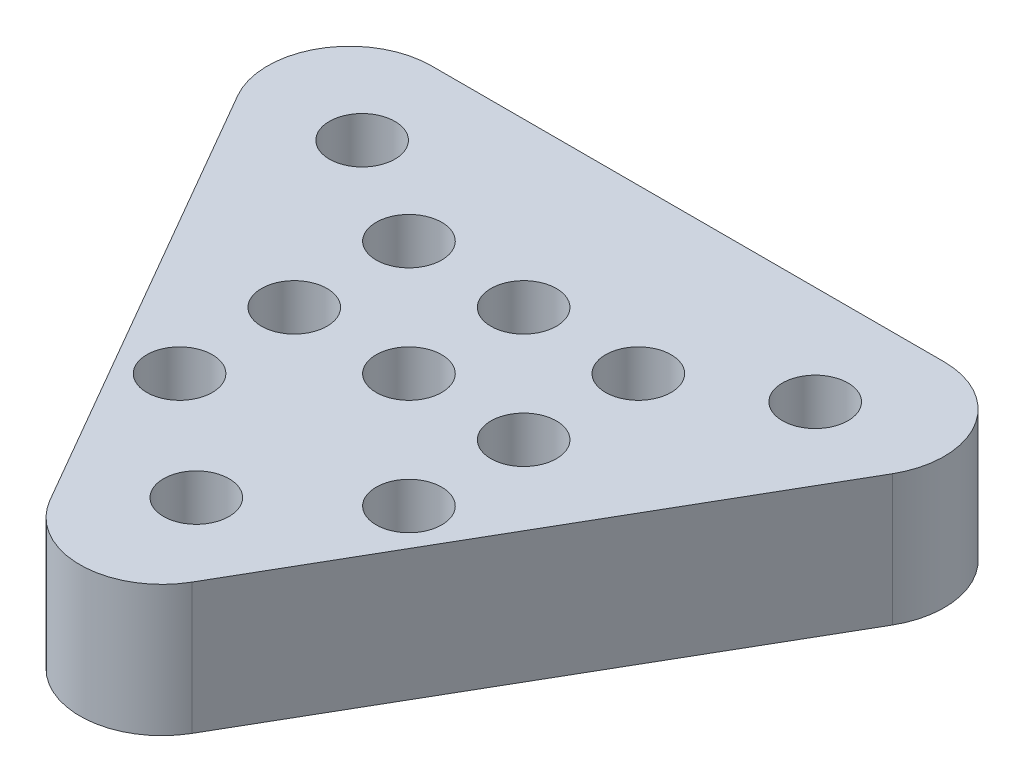
ISO-10303-21;
HEADER;
FILE_DESCRIPTION(('STEP AP214'),'2;1');
FILE_NAME('part.step','',(''),(''),'','','');
FILE_SCHEMA(('AUTOMOTIVE_DESIGN { 1 0 10303 214 1 1 1 1 }'));
ENDSEC;
DATA;
#1=APPLICATION_CONTEXT('core data for automotive mechanical design processes');
#2=APPLICATION_PROTOCOL_DEFINITION('international standard','automotive_design',2000,#1);
#3=PRODUCT_CONTEXT('',#1,'mechanical');
#4=PRODUCT('Part','Part','',(#3));
#5=PRODUCT_RELATED_PRODUCT_CATEGORY('part','',(#4));
#6=PRODUCT_DEFINITION_FORMATION('','',#4);
#7=PRODUCT_DEFINITION_CONTEXT('part definition',#1,'design');
#8=PRODUCT_DEFINITION('design','',#6,#7);
#9=PRODUCT_DEFINITION_SHAPE('','',#8);
#10=(LENGTH_UNIT() NAMED_UNIT(*) SI_UNIT(.MILLI.,.METRE.));
#11=(NAMED_UNIT(*) PLANE_ANGLE_UNIT() SI_UNIT($,.RADIAN.));
#12=(NAMED_UNIT(*) SI_UNIT($,.STERADIAN.) SOLID_ANGLE_UNIT());
#13=UNCERTAINTY_MEASURE_WITH_UNIT(LENGTH_MEASURE(1.E-05),#10,'distance_accuracy_value','');
#14=(GEOMETRIC_REPRESENTATION_CONTEXT(3) GLOBAL_UNCERTAINTY_ASSIGNED_CONTEXT((#13)) GLOBAL_UNIT_ASSIGNED_CONTEXT((#10,
#11,#12)) REPRESENTATION_CONTEXT('',''));
#15=CARTESIAN_POINT('',(0.,0.,0.));
#16=DIRECTION('',(0.,0.,1.));
#17=DIRECTION('',(1.,0.,0.));
#18=AXIS2_PLACEMENT_3D('',#15,#16,#17);
#19=CARTESIAN_POINT('',(-16.4111309816016,0.,1.40670066691417));
#20=DIRECTION('',(0.,1.,0.));
#21=DIRECTION('',(0.,0.,1.));
#22=AXIS2_PLACEMENT_3D('',#19,#20,#21);
#23=PLANE('',#22);
#24=CARTESIAN_POINT('',(11.7162263998497,0.,-4.04060624423478));
#25=DIRECTION('',(0.,1.,0.));
#26=DIRECTION('',(0.,0.,1.));
#27=AXIS2_PLACEMENT_3D('',#24,#25,#26);
#28=CIRCLE('',#27,2.38124999999978);
#29=CARTESIAN_POINT('',(11.7162263998497,0.,-1.659356244235));
#30=VERTEX_POINT('',#29);
#31=EDGE_CURVE('E297',#30,#30,#28,.T.);
#32=ORIENTED_EDGE('',*,*,#31,.T.);
#33=EDGE_LOOP('',(#32));
#34=FACE_BOUND('',#33,.T.);
#35=CARTESIAN_POINT('',(1.27033463203929,0.,-2.08860210500944));
#36=DIRECTION('',(0.,1.,0.));
#37=DIRECTION('',(0.,0.,1.));
#38=AXIS2_PLACEMENT_3D('',#35,#36,#37);
#39=CIRCLE('',#38,0.99999999999935);
#40=CARTESIAN_POINT('',(1.27033463203929,0.,-1.08860210501009));
#41=VERTEX_POINT('',#40);
#42=EDGE_CURVE('E181',#41,#41,#39,.T.);
#43=ORIENTED_EDGE('',*,*,#42,.T.);
#44=EDGE_LOOP('',(#43));
#45=FACE_BOUND('',#44,.T.);
#46=CARTESIAN_POINT('',(4.77033463203928,0.,-2.08860210500944));
#47=DIRECTION('',(0.,1.,0.));
#48=DIRECTION('',(0.,0.,1.));
#49=AXIS2_PLACEMENT_3D('',#46,#47,#48);
#50=CIRCLE('',#49,0.999999999999352);
#51=CARTESIAN_POINT('',(4.77033463203928,0.,-1.08860210501009));
#52=VERTEX_POINT('',#51);
#53=EDGE_CURVE('E178',#52,#52,#50,.T.);
#54=ORIENTED_EDGE('',*,*,#53,.T.);
#55=EDGE_LOOP('',(#54));
#56=FACE_BOUND('',#55,.T.);
#57=CARTESIAN_POINT('',(8.27033463203928,0.,-2.08860210500944));
#58=DIRECTION('',(0.,1.,0.));
#59=DIRECTION('',(0.,0.,1.));
#60=AXIS2_PLACEMENT_3D('',#57,#58,#59);
#61=CIRCLE('',#60,0.999999999999352);
#62=CARTESIAN_POINT('',(8.27033463203928,0.,-1.08860210501009));
#63=VERTEX_POINT('',#62);
#64=EDGE_CURVE('E175',#63,#63,#61,.T.);
#65=ORIENTED_EDGE('',*,*,#64,.T.);
#66=EDGE_LOOP('',(#65));
#67=FACE_BOUND('',#66,.T.);
#68=CARTESIAN_POINT('',(1.27033463203932,0.,1.41139789499056));
#69=DIRECTION('',(0.,1.,0.));
#70=DIRECTION('',(0.,0.,1.));
#71=AXIS2_PLACEMENT_3D('',#68,#69,#70);
#72=CIRCLE('',#71,0.99999999999935);
#73=CARTESIAN_POINT('',(1.27033463203932,0.,2.41139789498991));
#74=VERTEX_POINT('',#73);
#75=EDGE_CURVE('E172',#74,#74,#72,.T.);
#76=ORIENTED_EDGE('',*,*,#75,.T.);
#77=EDGE_LOOP('',(#76));
#78=FACE_BOUND('',#77,.T.);
#79=CARTESIAN_POINT('',(4.77033463203932,0.,1.41139789499056));
#80=DIRECTION('',(0.,1.,0.));
#81=DIRECTION('',(0.,0.,1.));
#82=AXIS2_PLACEMENT_3D('',#79,#80,#81);
#83=CIRCLE('',#82,0.999999999999351);
#84=CARTESIAN_POINT('',(4.77033463203932,0.,2.41139789498991));
#85=VERTEX_POINT('',#84);
#86=EDGE_CURVE('E169',#85,#85,#83,.T.);
#87=ORIENTED_EDGE('',*,*,#86,.T.);
#88=EDGE_LOOP('',(#87));
#89=FACE_BOUND('',#88,.T.);
#90=CARTESIAN_POINT('',(8.27033463203932,0.,1.41139789499056));
#91=DIRECTION('',(0.,1.,0.));
#92=DIRECTION('',(0.,0.,1.));
#93=AXIS2_PLACEMENT_3D('',#90,#91,#92);
#94=CIRCLE('',#93,0.999999999999353);
#95=CARTESIAN_POINT('',(8.27033463203932,0.,2.41139789498991));
#96=VERTEX_POINT('',#95);
#97=EDGE_CURVE('E166',#96,#96,#94,.T.);
#98=ORIENTED_EDGE('',*,*,#97,.T.);
#99=EDGE_LOOP('',(#98));
#100=FACE_BOUND('',#99,.T.);
#101=CARTESIAN_POINT('',(1.27033463203936,0.,4.91139789499056));
#102=DIRECTION('',(0.,1.,0.));
#103=DIRECTION('',(0.,0.,1.));
#104=AXIS2_PLACEMENT_3D('',#101,#102,#103);
#105=CIRCLE('',#104,0.99999999999935);
#106=CARTESIAN_POINT('',(1.27033463203936,0.,5.91139789498991));
#107=VERTEX_POINT('',#106);
#108=EDGE_CURVE('E163',#107,#107,#105,.T.);
#109=ORIENTED_EDGE('',*,*,#108,.T.);
#110=EDGE_LOOP('',(#109));
#111=FACE_BOUND('',#110,.T.);
#112=CARTESIAN_POINT('',(8.27033463203936,0.,4.91139789499056));
#113=DIRECTION('',(0.,1.,0.));
#114=DIRECTION('',(0.,0.,1.));
#115=AXIS2_PLACEMENT_3D('',#112,#113,#114);
#116=CIRCLE('',#115,0.999999999999353);
#117=CARTESIAN_POINT('',(8.27033463203936,0.,5.91139789498991));
#118=VERTEX_POINT('',#117);
#119=EDGE_CURVE('E160',#118,#118,#116,.T.);
#120=ORIENTED_EDGE('',*,*,#119,.T.);
#121=EDGE_LOOP('',(#120));
#122=FACE_BOUND('',#121,.T.);
#123=CARTESIAN_POINT('',(4.80279534308314,0.,8.98497991082132));
#124=DIRECTION('',(0.,1.,0.));
#125=DIRECTION('',(0.,0.,1.));
#126=AXIS2_PLACEMENT_3D('',#123,#124,#125);
#127=CIRCLE('',#126,2.49999999999977);
#128=CARTESIAN_POINT('',(6.96785885254408,0.,10.2349799108212));
#129=VERTEX_POINT('',#128);
#130=CARTESIAN_POINT('',(2.63773183362227,0.,10.2349799108212));
#131=VERTEX_POINT('',#130);
#132=EDGE_CURVE('E145',#129,#131,#127,.F.);
#133=ORIENTED_EDGE('',*,*,#132,.T.);
#134=DIRECTION('',(0.500000000000009,0.,0.866025403784433));
#135=VECTOR('',#134,1.);
#136=CARTESIAN_POINT('',(-5.9472409186471,0.,-4.63462907770341));
#137=LINE('',#136,#135);
#138=CARTESIAN_POINT('',(-5.18604114745607,0.,-3.31619239929076));
#139=VERTEX_POINT('',#138);
#140=EDGE_CURVE('E158',#139,#131,#137,.T.);
#141=ORIENTED_EDGE('',*,*,#140,.F.);
#142=CARTESIAN_POINT('',(-3.02097763799519,0.,-4.56619239929064));
#143=DIRECTION('',(0.,1.,0.));
#144=DIRECTION('',(0.,0.,1.));
#145=AXIS2_PLACEMENT_3D('',#142,#143,#144);
#146=CIRCLE('',#145,2.49999999999979);
#147=CARTESIAN_POINT('',(-3.02097763799516,0.,-7.06619239929047));
#148=VERTEX_POINT('',#147);
#149=EDGE_CURVE('E156',#139,#148,#146,.F.);
#150=ORIENTED_EDGE('',*,*,#149,.T.);
#151=DIRECTION('',(-1.,0.,0.));
#152=VECTOR('',#151,1.);
#153=CARTESIAN_POINT('',(-16.4111309816016,0.,-7.06619239929047));
#154=LINE('',#153,#152);
#155=CARTESIAN_POINT('',(12.6265683241614,0.,-7.06619239929047));
#156=VERTEX_POINT('',#155);
#157=EDGE_CURVE('E104',#156,#148,#154,.T.);
#158=ORIENTED_EDGE('',*,*,#157,.F.);
#159=CARTESIAN_POINT('',(12.6265683241614,0.,-4.56619239929068));
#160=DIRECTION('',(0.,1.,0.));
#161=DIRECTION('',(0.,0.,1.));
#162=AXIS2_PLACEMENT_3D('',#159,#160,#161);
#163=CIRCLE('',#162,2.49999999999979);
#164=CARTESIAN_POINT('',(14.7916318336224,0.,-3.31619239929077));
#165=VERTEX_POINT('',#164);
#166=EDGE_CURVE('E152',#165,#156,#163,.T.);
#167=ORIENTED_EDGE('',*,*,#166,.F.);
#168=DIRECTION('',(0.500000000000006,0.,-0.866025403784435));
#169=VECTOR('',#168,1.);
#170=CARTESIAN_POINT('',(4.94586844247072,0.,13.7371700334852));
#171=LINE('',#170,#169);
#172=EDGE_CURVE('E148',#129,#165,#171,.T.);
#173=ORIENTED_EDGE('',*,*,#172,.F.);
#174=EDGE_LOOP('',(#133,#141,#150,#158,#167,#173));
#175=FACE_BOUND('',#174,.T.);
#176=CARTESIAN_POINT('',(4.80279534308366,0.,7.93380760070953));
#177=DIRECTION('',(0.,1.,0.));
#178=DIRECTION('',(0.,0.,1.));
#179=AXIS2_PLACEMENT_3D('',#176,#177,#178);
#180=CIRCLE('',#179,2.3812500000002);
#181=CARTESIAN_POINT('',(4.80279534308366,0.,10.3150576007097));
#182=VERTEX_POINT('',#181);
#183=EDGE_CURVE('E300',#182,#182,#180,.T.);
#184=ORIENTED_EDGE('',*,*,#183,.T.);
#185=EDGE_LOOP('',(#184));
#186=FACE_BOUND('',#185,.T.);
#187=CARTESIAN_POINT('',(-2.11063571368337,0.,-4.04060624423479));
#188=DIRECTION('',(0.,1.,0.));
#189=DIRECTION('',(1.,0.,0.));
#190=AXIS2_PLACEMENT_3D('',#187,#188,#189);
#191=CIRCLE('',#190,2.38124999999993);
#192=CARTESIAN_POINT('',(0.27061428631656,0.,-4.04060624423479));
#193=VERTEX_POINT('',#192);
#194=EDGE_CURVE('E290',#193,#193,#191,.T.);
#195=ORIENTED_EDGE('',*,*,#194,.T.);
#196=EDGE_LOOP('',(#195));
#197=FACE_BOUND('',#196,.T.);
#198=ADVANCED_FACE('F31',(#34,#45,#56,#67,#78,#89,#100,#111,#122,#175,#186,#197),#23,.F.);
#199=CARTESIAN_POINT('',(4.80279534308314,4.,8.98497991082132));
#200=DIRECTION('',(0.,-1.,0.));
#201=DIRECTION('',(0.,0.,-1.));
#202=AXIS2_PLACEMENT_3D('',#199,#200,#201);
#203=CYLINDRICAL_SURFACE('',#202,2.49999999999977);
#204=ORIENTED_EDGE('',*,*,#132,.F.);
#205=DIRECTION('',(0.,-1.,0.));
#206=VECTOR('',#205,1.);
#207=CARTESIAN_POINT('',(6.96785885254408,4.,10.2349799108212));
#208=LINE('',#207,#206);
#209=CARTESIAN_POINT('',(6.96785885254408,4.,10.2349799108212));
#210=VERTEX_POINT('',#209);
#211=EDGE_CURVE('E11',#210,#129,#208,.T.);
#212=ORIENTED_EDGE('',*,*,#211,.F.);
#213=CARTESIAN_POINT('',(4.80279534308314,4.,8.98497991082132));
#214=DIRECTION('',(0.,1.,0.));
#215=DIRECTION('',(0.,0.,1.));
#216=AXIS2_PLACEMENT_3D('',#213,#214,#215);
#217=CIRCLE('',#216,2.49999999999977);
#218=CARTESIAN_POINT('',(2.63773183362227,4.,10.2349799108212));
#219=VERTEX_POINT('',#218);
#220=EDGE_CURVE('E315',#210,#219,#217,.F.);
#221=ORIENTED_EDGE('',*,*,#220,.T.);
#222=DIRECTION('',(0.,-1.,0.));
#223=VECTOR('',#222,1.);
#224=CARTESIAN_POINT('',(2.63773183362227,4.,10.2349799108212));
#225=LINE('',#224,#223);
#226=EDGE_CURVE('E77',#219,#131,#225,.T.);
#227=ORIENTED_EDGE('',*,*,#226,.T.);
#228=EDGE_LOOP('',(#204,#212,#221,#227));
#229=FACE_BOUND('',#228,.T.);
#230=ADVANCED_FACE('F197',(#229),#203,.T.);
#231=CARTESIAN_POINT('',(4.94586844247072,4.,13.7371700334852));
#232=DIRECTION('',(-0.866025403784435,0.,-0.500000000000006));
#233=DIRECTION('',(-0.500000000000006,0.,0.866025403784435));
#234=AXIS2_PLACEMENT_3D('',#231,#232,#233);
#235=PLANE('',#234);
#236=ORIENTED_EDGE('',*,*,#172,.T.);
#237=DIRECTION('',(0.,-1.,0.));
#238=VECTOR('',#237,1.);
#239=CARTESIAN_POINT('',(14.7916318336224,4.,-3.31619239929077));
#240=LINE('',#239,#238);
#241=CARTESIAN_POINT('',(14.7916318336224,4.,-3.31619239929077));
#242=VERTEX_POINT('',#241);
#243=EDGE_CURVE('E41',#242,#165,#240,.T.);
#244=ORIENTED_EDGE('',*,*,#243,.F.);
#245=DIRECTION('',(0.500000000000006,0.,-0.866025403784435));
#246=VECTOR('',#245,1.);
#247=CARTESIAN_POINT('',(4.94586844247072,4.,13.7371700334852));
#248=LINE('',#247,#246);
#249=EDGE_CURVE('E317',#210,#242,#248,.T.);
#250=ORIENTED_EDGE('',*,*,#249,.F.);
#251=ORIENTED_EDGE('',*,*,#211,.T.);
#252=EDGE_LOOP('',(#236,#244,#250,#251));
#253=FACE_BOUND('',#252,.T.);
#254=ADVANCED_FACE('F194',(#253),#235,.F.);
#255=CARTESIAN_POINT('',(12.6265683241614,4.,-4.56619239929068));
#256=DIRECTION('',(0.,-1.,0.));
#257=DIRECTION('',(0.,0.,-1.));
#258=AXIS2_PLACEMENT_3D('',#255,#256,#257);
#259=CYLINDRICAL_SURFACE('',#258,2.49999999999979);
#260=ORIENTED_EDGE('',*,*,#166,.T.);
#261=DIRECTION('',(0.,-1.,0.));
#262=VECTOR('',#261,1.);
#263=CARTESIAN_POINT('',(12.6265683241614,4.,-7.06619239929047));
#264=LINE('',#263,#262);
#265=CARTESIAN_POINT('',(12.6265683241614,4.,-7.06619239929047));
#266=VERTEX_POINT('',#265);
#267=EDGE_CURVE('E108',#266,#156,#264,.T.);
#268=ORIENTED_EDGE('',*,*,#267,.F.);
#269=CARTESIAN_POINT('',(12.6265683241614,4.,-4.56619239929068));
#270=DIRECTION('',(0.,1.,0.));
#271=DIRECTION('',(0.,0.,1.));
#272=AXIS2_PLACEMENT_3D('',#269,#270,#271);
#273=CIRCLE('',#272,2.49999999999979);
#274=EDGE_CURVE('E96',#242,#266,#273,.T.);
#275=ORIENTED_EDGE('',*,*,#274,.F.);
#276=ORIENTED_EDGE('',*,*,#243,.T.);
#277=EDGE_LOOP('',(#260,#268,#275,#276));
#278=FACE_BOUND('',#277,.T.);
#279=ADVANCED_FACE('F191',(#278),#259,.T.);
#280=CARTESIAN_POINT('',(-16.4111309816016,4.,-7.06619239929047));
#281=DIRECTION('',(0.,0.,1.));
#282=DIRECTION('',(1.,0.,0.));
#283=AXIS2_PLACEMENT_3D('',#280,#281,#282);
#284=PLANE('',#283);
#285=ORIENTED_EDGE('',*,*,#157,.T.);
#286=DIRECTION('',(0.,-1.,0.));
#287=VECTOR('',#286,1.);
#288=CARTESIAN_POINT('',(-3.02097763799516,4.,-7.06619239929047));
#289=LINE('',#288,#287);
#290=CARTESIAN_POINT('',(-3.02097763799516,4.,-7.06619239929047));
#291=VERTEX_POINT('',#290);
#292=EDGE_CURVE('E102',#291,#148,#289,.T.);
#293=ORIENTED_EDGE('',*,*,#292,.F.);
#294=DIRECTION('',(-1.,0.,0.));
#295=VECTOR('',#294,1.);
#296=CARTESIAN_POINT('',(-16.4111309816016,4.,-7.06619239929047));
#297=LINE('',#296,#295);
#298=EDGE_CURVE('E89',#266,#291,#297,.T.);
#299=ORIENTED_EDGE('',*,*,#298,.F.);
#300=ORIENTED_EDGE('',*,*,#267,.T.);
#301=EDGE_LOOP('',(#285,#293,#299,#300));
#302=FACE_BOUND('',#301,.T.);
#303=ADVANCED_FACE('F103',(#302),#284,.F.);
#304=CARTESIAN_POINT('',(-3.02097763799519,4.,-4.56619239929064));
#305=DIRECTION('',(0.,-1.,0.));
#306=DIRECTION('',(0.,0.,-1.));
#307=AXIS2_PLACEMENT_3D('',#304,#305,#306);
#308=CYLINDRICAL_SURFACE('',#307,2.49999999999979);
#309=ORIENTED_EDGE('',*,*,#149,.F.);
#310=DIRECTION('',(0.,-1.,0.));
#311=VECTOR('',#310,1.);
#312=CARTESIAN_POINT('',(-5.18604114745607,4.,-3.31619239929076));
#313=LINE('',#312,#311);
#314=CARTESIAN_POINT('',(-5.18604114745607,4.,-3.31619239929076));
#315=VERTEX_POINT('',#314);
#316=EDGE_CURVE('E70',#315,#139,#313,.T.);
#317=ORIENTED_EDGE('',*,*,#316,.F.);
#318=CARTESIAN_POINT('',(-3.02097763799519,4.,-4.56619239929064));
#319=DIRECTION('',(0.,1.,0.));
#320=DIRECTION('',(0.,0.,1.));
#321=AXIS2_PLACEMENT_3D('',#318,#319,#320);
#322=CIRCLE('',#321,2.49999999999979);
#323=EDGE_CURVE('E94',#315,#291,#322,.F.);
#324=ORIENTED_EDGE('',*,*,#323,.T.);
#325=ORIENTED_EDGE('',*,*,#292,.T.);
#326=EDGE_LOOP('',(#309,#317,#324,#325));
#327=FACE_BOUND('',#326,.T.);
#328=ADVANCED_FACE('F110',(#327),#308,.T.);
#329=CARTESIAN_POINT('',(4.80279534308366,4.,7.93380760070953));
#330=DIRECTION('',(0.,-1.,0.));
#331=DIRECTION('',(0.,0.,-1.));
#332=AXIS2_PLACEMENT_3D('',#329,#330,#331);
#333=CYLINDRICAL_SURFACE('',#332,0.999999999999184);
#334=CARTESIAN_POINT('',(4.80279534308366,2.,7.93380760070953));
#335=DIRECTION('',(0.,1.,0.));
#336=DIRECTION('',(0.,0.,1.));
#337=AXIS2_PLACEMENT_3D('',#334,#335,#336);
#338=CIRCLE('',#337,0.999999999999184);
#339=CARTESIAN_POINT('',(4.80279534308366,2.,8.93380760070871));
#340=VERTEX_POINT('',#339);
#341=EDGE_CURVE('E306',#340,#340,#338,.T.);
#342=ORIENTED_EDGE('',*,*,#341,.F.);
#343=EDGE_LOOP('',(#342));
#344=FACE_BOUND('',#343,.T.);
#345=CARTESIAN_POINT('',(4.80279534308366,4.,7.93380760070953));
#346=DIRECTION('',(0.,1.,0.));
#347=DIRECTION('',(0.,0.,1.));
#348=AXIS2_PLACEMENT_3D('',#345,#346,#347);
#349=CIRCLE('',#348,0.999999999999184);
#350=CARTESIAN_POINT('',(4.80279534308366,4.,8.93380760070871));
#351=VERTEX_POINT('',#350);
#352=EDGE_CURVE('E139',#351,#351,#349,.T.);
#353=ORIENTED_EDGE('',*,*,#352,.T.);
#354=EDGE_LOOP('',(#353));
#355=FACE_BOUND('',#354,.T.);
#356=ADVANCED_FACE('F213',(#344,#355),#333,.F.);
#357=CARTESIAN_POINT('',(1.27033463203929,4.,-2.08860210500944));
#358=DIRECTION('',(0.,-1.,0.));
#359=DIRECTION('',(0.,0.,-1.));
#360=AXIS2_PLACEMENT_3D('',#357,#358,#359);
#361=CYLINDRICAL_SURFACE('',#360,0.99999999999935);
#362=CARTESIAN_POINT('',(1.27033463203929,4.,-2.08860210500944));
#363=DIRECTION('',(0.,1.,0.));
#364=DIRECTION('',(0.,0.,1.));
#365=AXIS2_PLACEMENT_3D('',#362,#363,#364);
#366=CIRCLE('',#365,0.99999999999935);
#367=CARTESIAN_POINT('',(1.27033463203929,4.,-1.08860210501009));
#368=VERTEX_POINT('',#367);
#369=EDGE_CURVE('E136',#368,#368,#366,.T.);
#370=ORIENTED_EDGE('',*,*,#369,.T.);
#371=EDGE_LOOP('',(#370));
#372=FACE_BOUND('',#371,.T.);
#373=ORIENTED_EDGE('',*,*,#42,.F.);
#374=EDGE_LOOP('',(#373));
#375=FACE_BOUND('',#374,.T.);
#376=ADVANCED_FACE('F244',(#372,#375),#361,.F.);
#377=CARTESIAN_POINT('',(4.77033463203928,4.,-2.08860210500944));
#378=DIRECTION('',(0.,-1.,0.));
#379=DIRECTION('',(0.,0.,-1.));
#380=AXIS2_PLACEMENT_3D('',#377,#378,#379);
#381=CYLINDRICAL_SURFACE('',#380,0.999999999999352);
#382=CARTESIAN_POINT('',(4.77033463203928,4.,-2.08860210500944));
#383=DIRECTION('',(0.,1.,0.));
#384=DIRECTION('',(0.,0.,1.));
#385=AXIS2_PLACEMENT_3D('',#382,#383,#384);
#386=CIRCLE('',#385,0.999999999999352);
#387=CARTESIAN_POINT('',(4.77033463203928,4.,-1.08860210501009));
#388=VERTEX_POINT('',#387);
#389=EDGE_CURVE('E133',#388,#388,#386,.T.);
#390=ORIENTED_EDGE('',*,*,#389,.T.);
#391=EDGE_LOOP('',(#390));
#392=FACE_BOUND('',#391,.T.);
#393=ORIENTED_EDGE('',*,*,#53,.F.);
#394=EDGE_LOOP('',(#393));
#395=FACE_BOUND('',#394,.T.);
#396=ADVANCED_FACE('F240',(#392,#395),#381,.F.);
#397=CARTESIAN_POINT('',(8.27033463203928,4.,-2.08860210500944));
#398=DIRECTION('',(0.,-1.,0.));
#399=DIRECTION('',(0.,0.,-1.));
#400=AXIS2_PLACEMENT_3D('',#397,#398,#399);
#401=CYLINDRICAL_SURFACE('',#400,0.999999999999352);
#402=CARTESIAN_POINT('',(8.27033463203928,4.,-2.08860210500944));
#403=DIRECTION('',(0.,1.,0.));
#404=DIRECTION('',(0.,0.,1.));
#405=AXIS2_PLACEMENT_3D('',#402,#403,#404);
#406=CIRCLE('',#405,0.999999999999352);
#407=CARTESIAN_POINT('',(8.27033463203928,4.,-1.08860210501009));
#408=VERTEX_POINT('',#407);
#409=EDGE_CURVE('E130',#408,#408,#406,.T.);
#410=ORIENTED_EDGE('',*,*,#409,.T.);
#411=EDGE_LOOP('',(#410));
#412=FACE_BOUND('',#411,.T.);
#413=ORIENTED_EDGE('',*,*,#64,.F.);
#414=EDGE_LOOP('',(#413));
#415=FACE_BOUND('',#414,.T.);
#416=ADVANCED_FACE('F236',(#412,#415),#401,.F.);
#417=CARTESIAN_POINT('',(1.27033463203932,4.,1.41139789499056));
#418=DIRECTION('',(0.,-1.,0.));
#419=DIRECTION('',(0.,0.,-1.));
#420=AXIS2_PLACEMENT_3D('',#417,#418,#419);
#421=CYLINDRICAL_SURFACE('',#420,0.99999999999935);
#422=CARTESIAN_POINT('',(1.27033463203932,4.,1.41139789499056));
#423=DIRECTION('',(0.,1.,0.));
#424=DIRECTION('',(0.,0.,1.));
#425=AXIS2_PLACEMENT_3D('',#422,#423,#424);
#426=CIRCLE('',#425,0.99999999999935);
#427=CARTESIAN_POINT('',(1.27033463203932,4.,2.41139789498991));
#428=VERTEX_POINT('',#427);
#429=EDGE_CURVE('E127',#428,#428,#426,.T.);
#430=ORIENTED_EDGE('',*,*,#429,.T.);
#431=EDGE_LOOP('',(#430));
#432=FACE_BOUND('',#431,.T.);
#433=ORIENTED_EDGE('',*,*,#75,.F.);
#434=EDGE_LOOP('',(#433));
#435=FACE_BOUND('',#434,.T.);
#436=ADVANCED_FACE('F232',(#432,#435),#421,.F.);
#437=CARTESIAN_POINT('',(4.77033463203932,4.,1.41139789499056));
#438=DIRECTION('',(0.,-1.,0.));
#439=DIRECTION('',(0.,0.,-1.));
#440=AXIS2_PLACEMENT_3D('',#437,#438,#439);
#441=CYLINDRICAL_SURFACE('',#440,0.999999999999351);
#442=CARTESIAN_POINT('',(4.77033463203932,4.,1.41139789499056));
#443=DIRECTION('',(0.,1.,0.));
#444=DIRECTION('',(0.,0.,1.));
#445=AXIS2_PLACEMENT_3D('',#442,#443,#444);
#446=CIRCLE('',#445,0.999999999999351);
#447=CARTESIAN_POINT('',(4.77033463203932,4.,2.41139789498991));
#448=VERTEX_POINT('',#447);
#449=EDGE_CURVE('E124',#448,#448,#446,.T.);
#450=ORIENTED_EDGE('',*,*,#449,.T.);
#451=EDGE_LOOP('',(#450));
#452=FACE_BOUND('',#451,.T.);
#453=ORIENTED_EDGE('',*,*,#86,.F.);
#454=EDGE_LOOP('',(#453));
#455=FACE_BOUND('',#454,.T.);
#456=ADVANCED_FACE('F228',(#452,#455),#441,.F.);
#457=CARTESIAN_POINT('',(8.27033463203932,4.,1.41139789499056));
#458=DIRECTION('',(0.,-1.,0.));
#459=DIRECTION('',(0.,0.,-1.));
#460=AXIS2_PLACEMENT_3D('',#457,#458,#459);
#461=CYLINDRICAL_SURFACE('',#460,0.999999999999353);
#462=CARTESIAN_POINT('',(8.27033463203932,4.,1.41139789499056));
#463=DIRECTION('',(0.,1.,0.));
#464=DIRECTION('',(0.,0.,1.));
#465=AXIS2_PLACEMENT_3D('',#462,#463,#464);
#466=CIRCLE('',#465,0.999999999999353);
#467=CARTESIAN_POINT('',(8.27033463203932,4.,2.41139789498991));
#468=VERTEX_POINT('',#467);
#469=EDGE_CURVE('E121',#468,#468,#466,.T.);
#470=ORIENTED_EDGE('',*,*,#469,.T.);
#471=EDGE_LOOP('',(#470));
#472=FACE_BOUND('',#471,.T.);
#473=ORIENTED_EDGE('',*,*,#97,.F.);
#474=EDGE_LOOP('',(#473));
#475=FACE_BOUND('',#474,.T.);
#476=ADVANCED_FACE('F224',(#472,#475),#461,.F.);
#477=CARTESIAN_POINT('',(1.27033463203936,4.,4.91139789499056));
#478=DIRECTION('',(0.,-1.,0.));
#479=DIRECTION('',(0.,0.,-1.));
#480=AXIS2_PLACEMENT_3D('',#477,#478,#479);
#481=CYLINDRICAL_SURFACE('',#480,0.99999999999935);
#482=CARTESIAN_POINT('',(1.27033463203936,4.,4.91139789499056));
#483=DIRECTION('',(0.,1.,0.));
#484=DIRECTION('',(0.,0.,1.));
#485=AXIS2_PLACEMENT_3D('',#482,#483,#484);
#486=CIRCLE('',#485,0.99999999999935);
#487=CARTESIAN_POINT('',(1.27033463203936,4.,5.91139789498991));
#488=VERTEX_POINT('',#487);
#489=EDGE_CURVE('E118',#488,#488,#486,.T.);
#490=ORIENTED_EDGE('',*,*,#489,.T.);
#491=EDGE_LOOP('',(#490));
#492=FACE_BOUND('',#491,.T.);
#493=ORIENTED_EDGE('',*,*,#108,.F.);
#494=EDGE_LOOP('',(#493));
#495=FACE_BOUND('',#494,.T.);
#496=ADVANCED_FACE('F220',(#492,#495),#481,.F.);
#497=CARTESIAN_POINT('',(8.27033463203936,4.,4.91139789499056));
#498=DIRECTION('',(0.,-1.,0.));
#499=DIRECTION('',(0.,0.,-1.));
#500=AXIS2_PLACEMENT_3D('',#497,#498,#499);
#501=CYLINDRICAL_SURFACE('',#500,0.999999999999353);
#502=CARTESIAN_POINT('',(8.27033463203936,4.,4.91139789499056));
#503=DIRECTION('',(0.,1.,0.));
#504=DIRECTION('',(0.,0.,1.));
#505=AXIS2_PLACEMENT_3D('',#502,#503,#504);
#506=CIRCLE('',#505,0.999999999999353);
#507=CARTESIAN_POINT('',(8.27033463203936,4.,5.91139789498991));
#508=VERTEX_POINT('',#507);
#509=EDGE_CURVE('E112',#508,#508,#506,.T.);
#510=ORIENTED_EDGE('',*,*,#509,.T.);
#511=EDGE_LOOP('',(#510));
#512=FACE_BOUND('',#511,.T.);
#513=ORIENTED_EDGE('',*,*,#119,.F.);
#514=EDGE_LOOP('',(#513));
#515=FACE_BOUND('',#514,.T.);
#516=ADVANCED_FACE('F217',(#512,#515),#501,.F.);
#517=CARTESIAN_POINT('',(-5.9472409186471,4.,-4.63462907770341));
#518=DIRECTION('',(0.866025403784433,0.,-0.500000000000009));
#519=DIRECTION('',(-0.500000000000009,0.,-0.866025403784433));
#520=AXIS2_PLACEMENT_3D('',#517,#518,#519);
#521=PLANE('',#520);
#522=ORIENTED_EDGE('',*,*,#140,.T.);
#523=ORIENTED_EDGE('',*,*,#226,.F.);
#524=DIRECTION('',(0.500000000000009,0.,0.866025403784433));
#525=VECTOR('',#524,1.);
#526=CARTESIAN_POINT('',(-5.9472409186471,4.,-4.63462907770341));
#527=LINE('',#526,#525);
#528=EDGE_CURVE('E49',#315,#219,#527,.T.);
#529=ORIENTED_EDGE('',*,*,#528,.F.);
#530=ORIENTED_EDGE('',*,*,#316,.T.);
#531=EDGE_LOOP('',(#522,#523,#529,#530));
#532=FACE_BOUND('',#531,.T.);
#533=ADVANCED_FACE('F214',(#532),#521,.F.);
#534=CARTESIAN_POINT('',(-2.11063571368337,4.,-4.04060624423479));
#535=DIRECTION('',(0.,-1.,0.));
#536=DIRECTION('',(0.,0.,-1.));
#537=AXIS2_PLACEMENT_3D('',#534,#535,#536);
#538=CYLINDRICAL_SURFACE('',#537,0.999999999999496);
#539=CARTESIAN_POINT('',(-2.11063571368337,2.,-4.04060624423479));
#540=DIRECTION('',(0.,1.,0.));
#541=DIRECTION('',(0.,0.,1.));
#542=AXIS2_PLACEMENT_3D('',#539,#540,#541);
#543=CIRCLE('',#542,0.999999999999496);
#544=CARTESIAN_POINT('',(-2.11063571368337,2.,-3.0406062442353));
#545=VERTEX_POINT('',#544);
#546=EDGE_CURVE('E35',#545,#545,#543,.T.);
#547=ORIENTED_EDGE('',*,*,#546,.F.);
#548=EDGE_LOOP('',(#547));
#549=FACE_BOUND('',#548,.T.);
#550=CARTESIAN_POINT('',(-2.11063571368337,4.,-4.04060624423479));
#551=DIRECTION('',(0.,1.,0.));
#552=DIRECTION('',(0.,0.,1.));
#553=AXIS2_PLACEMENT_3D('',#550,#551,#552);
#554=CIRCLE('',#553,0.999999999999496);
#555=CARTESIAN_POINT('',(-2.11063571368337,4.,-3.0406062442353));
#556=VERTEX_POINT('',#555);
#557=EDGE_CURVE('E184',#556,#556,#554,.T.);
#558=ORIENTED_EDGE('',*,*,#557,.T.);
#559=EDGE_LOOP('',(#558));
#560=FACE_BOUND('',#559,.T.);
#561=ADVANCED_FACE('F33',(#549,#560),#538,.F.);
#562=CARTESIAN_POINT('',(11.7162263998497,4.,-4.04060624423478));
#563=DIRECTION('',(0.,-1.,0.));
#564=DIRECTION('',(0.,0.,-1.));
#565=AXIS2_PLACEMENT_3D('',#562,#563,#564);
#566=CYLINDRICAL_SURFACE('',#565,0.999999999999569);
#567=CARTESIAN_POINT('',(11.7162263998497,2.,-4.04060624423478));
#568=DIRECTION('',(0.,1.,0.));
#569=DIRECTION('',(0.,0.,1.));
#570=AXIS2_PLACEMENT_3D('',#567,#568,#569);
#571=CIRCLE('',#570,0.999999999999569);
#572=CARTESIAN_POINT('',(11.7162263998497,2.,-3.04060624423521));
#573=VERTEX_POINT('',#572);
#574=EDGE_CURVE('E301',#573,#573,#571,.T.);
#575=ORIENTED_EDGE('',*,*,#574,.F.);
#576=EDGE_LOOP('',(#575));
#577=FACE_BOUND('',#576,.T.);
#578=CARTESIAN_POINT('',(11.7162263998497,4.,-4.04060624423478));
#579=DIRECTION('',(0.,1.,0.));
#580=DIRECTION('',(0.,0.,1.));
#581=AXIS2_PLACEMENT_3D('',#578,#579,#580);
#582=CIRCLE('',#581,0.999999999999569);
#583=CARTESIAN_POINT('',(11.7162263998497,4.,-3.04060624423521));
#584=VERTEX_POINT('',#583);
#585=EDGE_CURVE('E142',#584,#584,#582,.T.);
#586=ORIENTED_EDGE('',*,*,#585,.T.);
#587=EDGE_LOOP('',(#586));
#588=FACE_BOUND('',#587,.T.);
#589=ADVANCED_FACE('F252',(#577,#588),#566,.F.);
#590=CARTESIAN_POINT('',(-16.4111309816016,4.,1.40670066691417));
#591=DIRECTION('',(0.,1.,0.));
#592=DIRECTION('',(0.,0.,1.));
#593=AXIS2_PLACEMENT_3D('',#590,#591,#592);
#594=PLANE('',#593);
#595=ORIENTED_EDGE('',*,*,#557,.F.);
#596=EDGE_LOOP('',(#595));
#597=FACE_BOUND('',#596,.T.);
#598=ORIENTED_EDGE('',*,*,#220,.F.);
#599=ORIENTED_EDGE('',*,*,#249,.T.);
#600=ORIENTED_EDGE('',*,*,#274,.T.);
#601=ORIENTED_EDGE('',*,*,#298,.T.);
#602=ORIENTED_EDGE('',*,*,#323,.F.);
#603=ORIENTED_EDGE('',*,*,#528,.T.);
#604=EDGE_LOOP('',(#598,#599,#600,#601,#602,#603));
#605=FACE_BOUND('',#604,.T.);
#606=ORIENTED_EDGE('',*,*,#509,.F.);
#607=EDGE_LOOP('',(#606));
#608=FACE_BOUND('',#607,.T.);
#609=ORIENTED_EDGE('',*,*,#489,.F.);
#610=EDGE_LOOP('',(#609));
#611=FACE_BOUND('',#610,.T.);
#612=ORIENTED_EDGE('',*,*,#469,.F.);
#613=EDGE_LOOP('',(#612));
#614=FACE_BOUND('',#613,.T.);
#615=ORIENTED_EDGE('',*,*,#449,.F.);
#616=EDGE_LOOP('',(#615));
#617=FACE_BOUND('',#616,.T.);
#618=ORIENTED_EDGE('',*,*,#429,.F.);
#619=EDGE_LOOP('',(#618));
#620=FACE_BOUND('',#619,.T.);
#621=ORIENTED_EDGE('',*,*,#409,.F.);
#622=EDGE_LOOP('',(#621));
#623=FACE_BOUND('',#622,.T.);
#624=ORIENTED_EDGE('',*,*,#389,.F.);
#625=EDGE_LOOP('',(#624));
#626=FACE_BOUND('',#625,.T.);
#627=ORIENTED_EDGE('',*,*,#369,.F.);
#628=EDGE_LOOP('',(#627));
#629=FACE_BOUND('',#628,.T.);
#630=ORIENTED_EDGE('',*,*,#352,.F.);
#631=EDGE_LOOP('',(#630));
#632=FACE_BOUND('',#631,.T.);
#633=ORIENTED_EDGE('',*,*,#585,.F.);
#634=EDGE_LOOP('',(#633));
#635=FACE_BOUND('',#634,.T.);
#636=ADVANCED_FACE('F91',(#597,#605,#608,#611,#614,#617,#620,#623,#626,#629,#632,#635),#594,.T.);
#637=CARTESIAN_POINT('',(4.80279534308366,2.,7.93380760070953));
#638=DIRECTION('',(0.,-1.,0.));
#639=DIRECTION('',(0.,0.,-1.));
#640=AXIS2_PLACEMENT_3D('',#637,#638,#639);
#641=CYLINDRICAL_SURFACE('',#640,2.3812500000002);
#642=CARTESIAN_POINT('',(4.80279534308366,2.,7.93380760070953));
#643=DIRECTION('',(0.,1.,0.));
#644=DIRECTION('',(0.,0.,1.));
#645=AXIS2_PLACEMENT_3D('',#642,#643,#644);
#646=CIRCLE('',#645,2.3812500000002);
#647=CARTESIAN_POINT('',(4.80279534308366,2.,10.3150576007097));
#648=VERTEX_POINT('',#647);
#649=EDGE_CURVE('E149',#648,#648,#646,.T.);
#650=ORIENTED_EDGE('',*,*,#649,.T.);
#651=EDGE_LOOP('',(#650));
#652=FACE_BOUND('',#651,.T.);
#653=ORIENTED_EDGE('',*,*,#183,.F.);
#654=EDGE_LOOP('',(#653));
#655=FACE_BOUND('',#654,.T.);
#656=ADVANCED_FACE('F258',(#652,#655),#641,.F.);
#657=CARTESIAN_POINT('',(-16.4111309816016,2.,1.40670066691417));
#658=DIRECTION('',(0.,1.,0.));
#659=DIRECTION('',(0.,0.,1.));
#660=AXIS2_PLACEMENT_3D('',#657,#658,#659);
#661=PLANE('',#660);
#662=ORIENTED_EDGE('',*,*,#341,.T.);
#663=EDGE_LOOP('',(#662));
#664=FACE_BOUND('',#663,.T.);
#665=ORIENTED_EDGE('',*,*,#649,.F.);
#666=EDGE_LOOP('',(#665));
#667=FACE_BOUND('',#666,.T.);
#668=ADVANCED_FACE('F262',(#664,#667),#661,.F.);
#669=CARTESIAN_POINT('',(11.7162263998497,2.,-4.04060624423478));
#670=DIRECTION('',(0.,-1.,0.));
#671=DIRECTION('',(0.,0.,-1.));
#672=AXIS2_PLACEMENT_3D('',#669,#670,#671);
#673=CYLINDRICAL_SURFACE('',#672,2.38124999999978);
#674=CARTESIAN_POINT('',(11.7162263998497,2.,-4.04060624423478));
#675=DIRECTION('',(0.,1.,0.));
#676=DIRECTION('',(0.,0.,1.));
#677=AXIS2_PLACEMENT_3D('',#674,#675,#676);
#678=CIRCLE('',#677,2.38124999999978);
#679=CARTESIAN_POINT('',(11.7162263998497,2.,-1.659356244235));
#680=VERTEX_POINT('',#679);
#681=EDGE_CURVE('E294',#680,#680,#678,.T.);
#682=ORIENTED_EDGE('',*,*,#681,.T.);
#683=EDGE_LOOP('',(#682));
#684=FACE_BOUND('',#683,.T.);
#685=ORIENTED_EDGE('',*,*,#31,.F.);
#686=EDGE_LOOP('',(#685));
#687=FACE_BOUND('',#686,.T.);
#688=ADVANCED_FACE('F266',(#684,#687),#673,.F.);
#689=CARTESIAN_POINT('',(-16.4111309816016,2.,1.40670066691417));
#690=DIRECTION('',(0.,1.,0.));
#691=DIRECTION('',(0.,0.,1.));
#692=AXIS2_PLACEMENT_3D('',#689,#690,#691);
#693=PLANE('',#692);
#694=ORIENTED_EDGE('',*,*,#574,.T.);
#695=EDGE_LOOP('',(#694));
#696=FACE_BOUND('',#695,.T.);
#697=ORIENTED_EDGE('',*,*,#681,.F.);
#698=EDGE_LOOP('',(#697));
#699=FACE_BOUND('',#698,.T.);
#700=ADVANCED_FACE('F268',(#696,#699),#693,.F.);
#701=CARTESIAN_POINT('',(-2.11063571368337,2.,-4.04060624423479));
#702=DIRECTION('',(0.,-1.,0.));
#703=DIRECTION('',(0.,0.,-1.));
#704=AXIS2_PLACEMENT_3D('',#701,#702,#703);
#705=CYLINDRICAL_SURFACE('',#704,2.38124999999993);
#706=CARTESIAN_POINT('',(-2.11063571368337,2.,-4.04060624423479));
#707=DIRECTION('',(0.,1.,0.));
#708=DIRECTION('',(1.,0.,0.));
#709=AXIS2_PLACEMENT_3D('',#706,#707,#708);
#710=CIRCLE('',#709,2.38124999999993);
#711=CARTESIAN_POINT('',(0.27061428631656,2.,-4.04060624423479));
#712=VERTEX_POINT('',#711);
#713=EDGE_CURVE('E287',#712,#712,#710,.T.);
#714=ORIENTED_EDGE('',*,*,#713,.T.);
#715=EDGE_LOOP('',(#714));
#716=FACE_BOUND('',#715,.T.);
#717=ORIENTED_EDGE('',*,*,#194,.F.);
#718=EDGE_LOOP('',(#717));
#719=FACE_BOUND('',#718,.T.);
#720=ADVANCED_FACE('F271',(#716,#719),#705,.F.);
#721=CARTESIAN_POINT('',(-2.11063571368337,2.,-4.04060624423479));
#722=DIRECTION('',(0.,1.,0.));
#723=DIRECTION('',(1.,0.,0.));
#724=AXIS2_PLACEMENT_3D('',#721,#722,#723);
#725=PLANE('',#724);
#726=ORIENTED_EDGE('',*,*,#546,.T.);
#727=EDGE_LOOP('',(#726));
#728=FACE_BOUND('',#727,.T.);
#729=ORIENTED_EDGE('',*,*,#713,.F.);
#730=EDGE_LOOP('',(#729));
#731=FACE_BOUND('',#730,.T.);
#732=ADVANCED_FACE('F276',(#728,#731),#725,.F.);
#733=CLOSED_SHELL('',(#198,#230,#254,#279,#303,#328,#356,#376,#396,#416,#436,#456,#476,#496,
#516,#533,#561,#589,#636,#656,#668,#688,#700,#720,#732));
#734=MANIFOLD_SOLID_BREP('B2',#733);
#735=ADVANCED_BREP_SHAPE_REPRESENTATION('',(#18,#734),#14);
#736=SHAPE_DEFINITION_REPRESENTATION(#9,#735);
ENDSEC;
END-ISO-10303-21;
